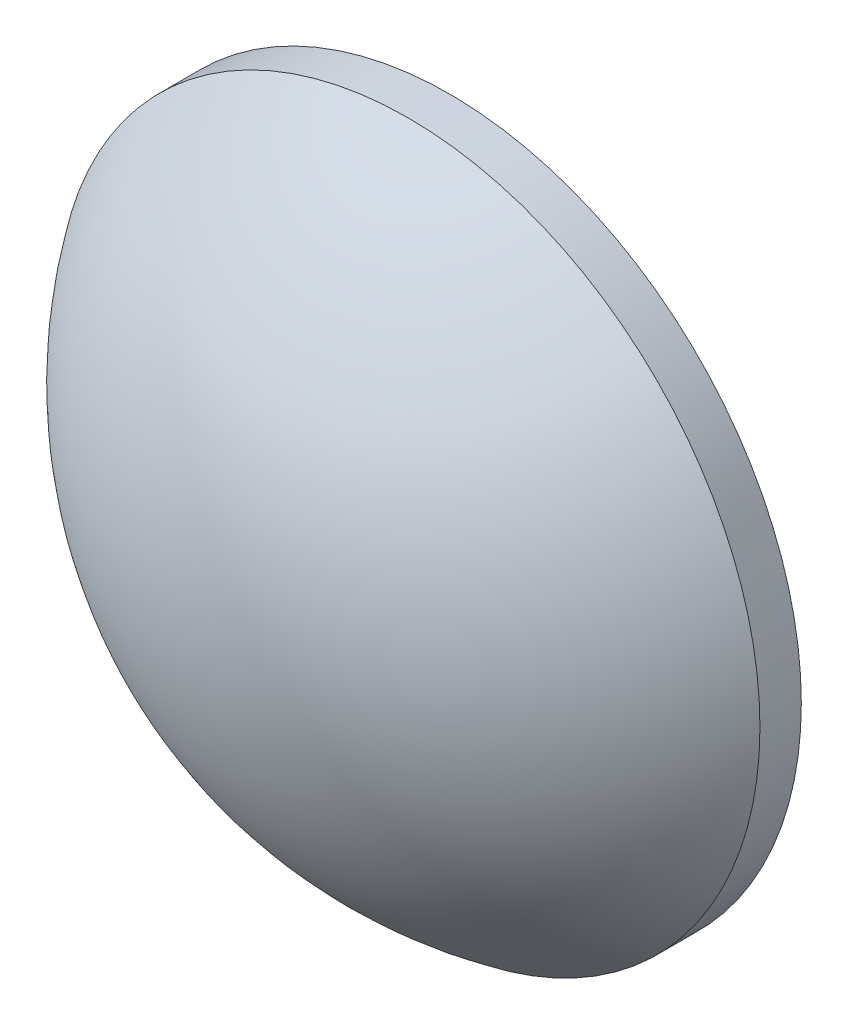
ISO-10303-21;
HEADER;
FILE_DESCRIPTION(('STEP AP214'),'2;1');
FILE_NAME('part.step','',(''),(''),'','','');
FILE_SCHEMA(('AUTOMOTIVE_DESIGN { 1 0 10303 214 1 1 1 1 }'));
ENDSEC;
DATA;
#1=APPLICATION_CONTEXT('core data for automotive mechanical design processes');
#2=APPLICATION_PROTOCOL_DEFINITION('international standard','automotive_design',2000,#1);
#3=PRODUCT_CONTEXT('',#1,'mechanical');
#4=PRODUCT('Part','Part','',(#3));
#5=PRODUCT_RELATED_PRODUCT_CATEGORY('part','',(#4));
#6=PRODUCT_DEFINITION_FORMATION('','',#4);
#7=PRODUCT_DEFINITION_CONTEXT('part definition',#1,'design');
#8=PRODUCT_DEFINITION('design','',#6,#7);
#9=PRODUCT_DEFINITION_SHAPE('','',#8);
#10=(LENGTH_UNIT() NAMED_UNIT(*) SI_UNIT(.MILLI.,.METRE.));
#11=(NAMED_UNIT(*) PLANE_ANGLE_UNIT() SI_UNIT($,.RADIAN.));
#12=(NAMED_UNIT(*) SI_UNIT($,.STERADIAN.) SOLID_ANGLE_UNIT());
#13=UNCERTAINTY_MEASURE_WITH_UNIT(LENGTH_MEASURE(1.E-05),#10,'distance_accuracy_value','');
#14=(GEOMETRIC_REPRESENTATION_CONTEXT(3) GLOBAL_UNCERTAINTY_ASSIGNED_CONTEXT((#13)) GLOBAL_UNIT_ASSIGNED_CONTEXT((#10,
#11,#12)) REPRESENTATION_CONTEXT('',''));
#15=CARTESIAN_POINT('',(0.,0.,0.));
#16=DIRECTION('',(0.,0.,1.));
#17=DIRECTION('',(1.,0.,0.));
#18=AXIS2_PLACEMENT_3D('',#15,#16,#17);
#19=CARTESIAN_POINT('',(0.,0.,-22.755));
#20=DIRECTION('',(0.,0.,1.));
#21=DIRECTION('',(0.,1.,0.));
#22=AXIS2_PLACEMENT_3D('',#19,#20,#21);
#23=SPHERICAL_SURFACE('',#22,30.9);
#24=CARTESIAN_POINT('',(0.,0.,-5.1581252774818));
#25=DIRECTION('',(0.,0.,1.));
#26=DIRECTION('',(1.,0.,0.));
#27=AXIS2_PLACEMENT_3D('',#24,#25,#26);
#28=CIRCLE('',#27,25.4);
#29=CARTESIAN_POINT('',(25.4,0.,-5.1581252774818));
#30=VERTEX_POINT('',#29);
#31=EDGE_CURVE('E12',#30,#30,#28,.T.);
#32=ORIENTED_EDGE('',*,*,#31,.T.);
#33=EDGE_LOOP('',(#32));
#34=FACE_BOUND('',#33,.T.);
#35=ADVANCED_FACE('F22',(#34),#23,.T.);
#36=CARTESIAN_POINT('',(0.,0.,4.30813204540037));
#37=DIRECTION('',(0.,0.,1.));
#38=DIRECTION('',(1.,0.,0.));
#39=AXIS2_PLACEMENT_3D('',#36,#37,#38);
#40=CYLINDRICAL_SURFACE('',#39,25.4);
#41=ORIENTED_EDGE('',*,*,#31,.F.);
#42=EDGE_LOOP('',(#41));
#43=FACE_BOUND('',#42,.T.);
#44=CARTESIAN_POINT('',(0.,0.,-8.145));
#45=DIRECTION('',(0.,0.,1.));
#46=DIRECTION('',(1.,0.,0.));
#47=AXIS2_PLACEMENT_3D('',#44,#45,#46);
#48=CIRCLE('',#47,25.4);
#49=CARTESIAN_POINT('',(25.4,0.,-8.145));
#50=VERTEX_POINT('',#49);
#51=EDGE_CURVE('E28',#50,#50,#48,.T.);
#52=ORIENTED_EDGE('',*,*,#51,.T.);
#53=EDGE_LOOP('',(#52));
#54=FACE_BOUND('',#53,.T.);
#55=ADVANCED_FACE('F34',(#43,#54),#40,.T.);
#56=CARTESIAN_POINT('',(0.,0.,-8.145));
#57=DIRECTION('',(0.,0.,1.));
#58=DIRECTION('',(1.,0.,0.));
#59=AXIS2_PLACEMENT_3D('',#56,#57,#58);
#60=PLANE('',#59);
#61=ORIENTED_EDGE('',*,*,#51,.F.);
#62=EDGE_LOOP('',(#61));
#63=FACE_BOUND('',#62,.T.);
#64=ADVANCED_FACE('F36',(#63),#60,.F.);
#65=CLOSED_SHELL('',(#35,#55,#64));
#66=MANIFOLD_SOLID_BREP('B1',#65);
#67=ADVANCED_BREP_SHAPE_REPRESENTATION('',(#18,#66),#14);
#68=SHAPE_DEFINITION_REPRESENTATION(#9,#67);
ENDSEC;
END-ISO-10303-21;
